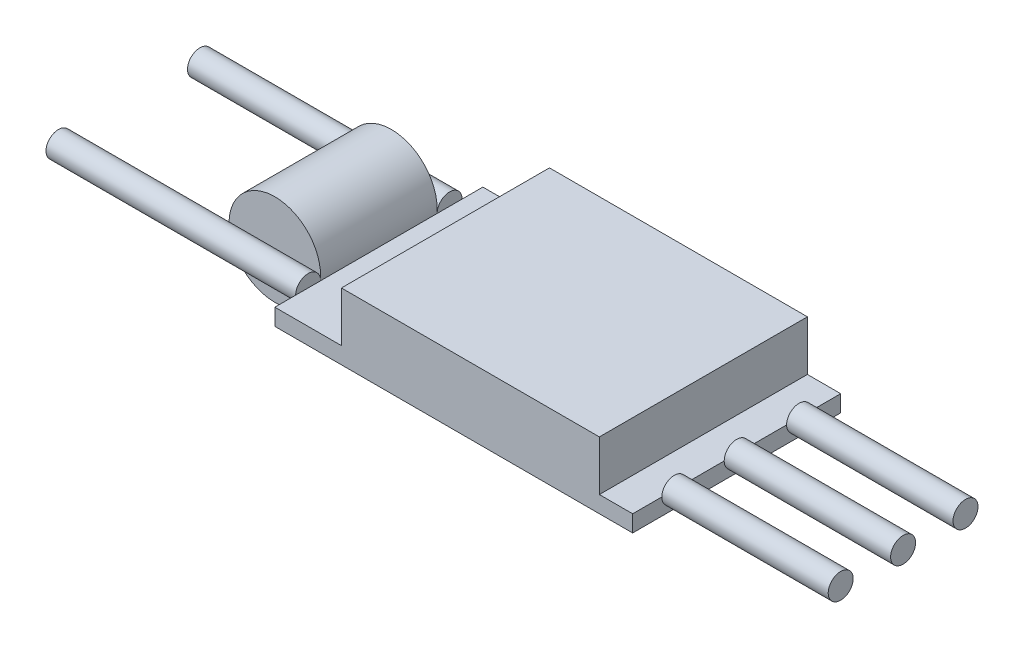
ISO-10303-21;
HEADER;
FILE_DESCRIPTION(('STEP AP214'),'2;1');
FILE_NAME('part.step','',(''),(''),'','','');
FILE_SCHEMA(('AUTOMOTIVE_DESIGN { 1 0 10303 214 1 1 1 1 }'));
ENDSEC;
DATA;
#1=APPLICATION_CONTEXT('core data for automotive mechanical design processes');
#2=APPLICATION_PROTOCOL_DEFINITION('international standard','automotive_design',2000,#1);
#3=PRODUCT_CONTEXT('',#1,'mechanical');
#4=PRODUCT('Part','Part','',(#3));
#5=PRODUCT_RELATED_PRODUCT_CATEGORY('part','',(#4));
#6=PRODUCT_DEFINITION_FORMATION('','',#4);
#7=PRODUCT_DEFINITION_CONTEXT('part definition',#1,'design');
#8=PRODUCT_DEFINITION('design','',#6,#7);
#9=PRODUCT_DEFINITION_SHAPE('','',#8);
#10=(LENGTH_UNIT() NAMED_UNIT(*) SI_UNIT(.MILLI.,.METRE.));
#11=(NAMED_UNIT(*) PLANE_ANGLE_UNIT() SI_UNIT($,.RADIAN.));
#12=(NAMED_UNIT(*) SI_UNIT($,.STERADIAN.) SOLID_ANGLE_UNIT());
#13=UNCERTAINTY_MEASURE_WITH_UNIT(LENGTH_MEASURE(1.E-05),#10,'distance_accuracy_value','');
#14=(GEOMETRIC_REPRESENTATION_CONTEXT(3) GLOBAL_UNCERTAINTY_ASSIGNED_CONTEXT((#13)) GLOBAL_UNIT_ASSIGNED_CONTEXT((#10,
#11,#12)) REPRESENTATION_CONTEXT('',''));
#15=CARTESIAN_POINT('',(0.,0.,0.));
#16=DIRECTION('',(0.,0.,1.));
#17=DIRECTION('',(1.,0.,0.));
#18=AXIS2_PLACEMENT_3D('',#15,#16,#17);
#19=CARTESIAN_POINT('',(-27.,2.5,7.));
#20=DIRECTION('',(0.,0.,-1.));
#21=DIRECTION('',(-1.,0.,0.));
#22=AXIS2_PLACEMENT_3D('',#19,#20,#21);
#23=CYLINDRICAL_SURFACE('',#22,5.5);
#24=CARTESIAN_POINT('',(-27.,2.5,7.));
#25=DIRECTION('',(0.,0.,1.));
#26=DIRECTION('',(1.,0.,0.));
#27=AXIS2_PLACEMENT_3D('',#24,#25,#26);
#28=CIRCLE('',#27,5.5);
#29=CARTESIAN_POINT('',(-21.5,2.5,7.));
#30=VERTEX_POINT('',#29);
#31=EDGE_CURVE('E11',#30,#30,#28,.T.);
#32=ORIENTED_EDGE('',*,*,#31,.F.);
#33=EDGE_LOOP('',(#32));
#34=FACE_BOUND('',#33,.T.);
#35=CARTESIAN_POINT('',(-27.,2.5,-7.));
#36=DIRECTION('',(0.,0.,1.));
#37=DIRECTION('',(1.,0.,0.));
#38=AXIS2_PLACEMENT_3D('',#35,#36,#37);
#39=CIRCLE('',#38,5.5);
#40=CARTESIAN_POINT('',(-21.5,2.5,-7.));
#41=VERTEX_POINT('',#40);
#42=EDGE_CURVE('E47',#41,#41,#39,.T.);
#43=ORIENTED_EDGE('',*,*,#42,.T.);
#44=EDGE_LOOP('',(#43));
#45=FACE_BOUND('',#44,.T.);
#46=ADVANCED_FACE('F44',(#34,#45),#23,.T.);
#47=CARTESIAN_POINT('',(-27.,2.5,7.));
#48=DIRECTION('',(0.,0.,1.));
#49=DIRECTION('',(1.,0.,0.));
#50=AXIS2_PLACEMENT_3D('',#47,#48,#49);
#51=PLANE('',#50);
#52=ORIENTED_EDGE('',*,*,#31,.T.);
#53=EDGE_LOOP('',(#52));
#54=FACE_BOUND('',#53,.T.);
#55=ADVANCED_FACE('F59',(#54),#51,.T.);
#56=CARTESIAN_POINT('',(-27.,2.5,-7.));
#57=DIRECTION('',(0.,0.,1.));
#58=DIRECTION('',(1.,0.,0.));
#59=AXIS2_PLACEMENT_3D('',#56,#57,#58);
#60=PLANE('',#59);
#61=ORIENTED_EDGE('',*,*,#42,.F.);
#62=EDGE_LOOP('',(#61));
#63=FACE_BOUND('',#62,.T.);
#64=ADVANCED_FACE('F57',(#63),#60,.F.);
#65=CLOSED_SHELL('',(#46,#55,#64));
#66=MANIFOLD_SOLID_BREP('B2',#65);
#67=CARTESIAN_POINT('',(21.5,2.,12.5));
#68=DIRECTION('',(-1.,0.,0.));
#69=DIRECTION('',(0.,0.,1.));
#70=AXIS2_PLACEMENT_3D('',#67,#68,#69);
#71=PLANE('',#70);
#72=CARTESIAN_POINT('',(21.5,2.,-7.5));
#73=DIRECTION('',(1.,0.,0.));
#74=DIRECTION('',(0.,0.,-1.));
#75=AXIS2_PLACEMENT_3D('',#72,#73,#74);
#76=CIRCLE('',#75,1.5);
#77=CARTESIAN_POINT('',(21.5,2.,-6.));
#78=VERTEX_POINT('',#77);
#79=CARTESIAN_POINT('',(21.5,2.,-9.00000000000001));
#80=VERTEX_POINT('',#79);
#81=EDGE_CURVE('E190',#78,#80,#76,.T.);
#82=ORIENTED_EDGE('',*,*,#81,.F.);
#83=DIRECTION('',(0.,0.,-1.));
#84=VECTOR('',#83,1.);
#85=CARTESIAN_POINT('',(21.5,2.,12.5));
#86=LINE('',#85,#84);
#87=CARTESIAN_POINT('',(21.5,2.,-1.5));
#88=VERTEX_POINT('',#87);
#89=EDGE_CURVE('E184',#88,#78,#86,.T.);
#90=ORIENTED_EDGE('',*,*,#89,.F.);
#91=CARTESIAN_POINT('',(21.5,2.,0.));
#92=DIRECTION('',(1.,0.,0.));
#93=DIRECTION('',(0.,0.,-1.));
#94=AXIS2_PLACEMENT_3D('',#91,#92,#93);
#95=CIRCLE('',#94,1.5);
#96=CARTESIAN_POINT('',(21.5,2.,1.5));
#97=VERTEX_POINT('',#96);
#98=EDGE_CURVE('E315',#97,#88,#95,.T.);
#99=ORIENTED_EDGE('',*,*,#98,.F.);
#100=CARTESIAN_POINT('',(21.5,2.,6.));
#101=VERTEX_POINT('',#100);
#102=EDGE_CURVE('E202',#101,#97,#86,.T.);
#103=ORIENTED_EDGE('',*,*,#102,.F.);
#104=CARTESIAN_POINT('',(21.5,2.,7.5));
#105=DIRECTION('',(1.,0.,0.));
#106=DIRECTION('',(0.,0.,-1.));
#107=AXIS2_PLACEMENT_3D('',#104,#105,#106);
#108=CIRCLE('',#107,1.5);
#109=CARTESIAN_POINT('',(21.5,2.,9.00000000000001));
#110=VERTEX_POINT('',#109);
#111=EDGE_CURVE('E42',#110,#101,#108,.T.);
#112=ORIENTED_EDGE('',*,*,#111,.F.);
#113=CARTESIAN_POINT('',(21.5,2.,12.5));
#114=VERTEX_POINT('',#113);
#115=EDGE_CURVE('E203',#114,#110,#86,.T.);
#116=ORIENTED_EDGE('',*,*,#115,.F.);
#117=DIRECTION('',(0.,-1.,0.));
#118=VECTOR('',#117,1.);
#119=CARTESIAN_POINT('',(21.5,2.,12.5));
#120=LINE('',#119,#118);
#121=CARTESIAN_POINT('',(21.5,0.,12.5));
#122=VERTEX_POINT('',#121);
#123=EDGE_CURVE('E230',#114,#122,#120,.T.);
#124=ORIENTED_EDGE('',*,*,#123,.T.);
#125=DIRECTION('',(0.,0.,-1.));
#126=VECTOR('',#125,1.);
#127=CARTESIAN_POINT('',(21.5,0.,12.5));
#128=LINE('',#127,#126);
#129=CARTESIAN_POINT('',(21.5,0.,-12.5));
#130=VERTEX_POINT('',#129);
#131=EDGE_CURVE('E241',#122,#130,#128,.T.);
#132=ORIENTED_EDGE('',*,*,#131,.T.);
#133=DIRECTION('',(0.,-1.,0.));
#134=VECTOR('',#133,1.);
#135=CARTESIAN_POINT('',(21.5,2.,-12.5));
#136=LINE('',#135,#134);
#137=CARTESIAN_POINT('',(21.5,2.,-12.5));
#138=VERTEX_POINT('',#137);
#139=EDGE_CURVE('E233',#138,#130,#136,.T.);
#140=ORIENTED_EDGE('',*,*,#139,.F.);
#141=EDGE_CURVE('E185',#80,#138,#86,.T.);
#142=ORIENTED_EDGE('',*,*,#141,.F.);
#143=EDGE_LOOP('',(#82,#90,#99,#103,#112,#116,#124,#132,#140,#142));
#144=FACE_BOUND('',#143,.T.);
#145=ADVANCED_FACE('F84',(#144),#71,.F.);
#146=CARTESIAN_POINT('',(-21.5,2.,12.5));
#147=DIRECTION('',(1.,0.,0.));
#148=DIRECTION('',(0.,0.,-1.));
#149=AXIS2_PLACEMENT_3D('',#146,#147,#148);
#150=PLANE('',#149);
#151=CARTESIAN_POINT('',(-21.5,2.,8.5));
#152=DIRECTION('',(-1.,0.,0.));
#153=DIRECTION('',(0.,0.,1.));
#154=AXIS2_PLACEMENT_3D('',#151,#152,#153);
#155=CIRCLE('',#154,1.5);
#156=CARTESIAN_POINT('',(-21.5,2.,7.));
#157=VERTEX_POINT('',#156);
#158=CARTESIAN_POINT('',(-21.5,2.,10.));
#159=VERTEX_POINT('',#158);
#160=EDGE_CURVE('E306',#157,#159,#155,.T.);
#161=ORIENTED_EDGE('',*,*,#160,.F.);
#162=DIRECTION('',(0.,0.,1.));
#163=VECTOR('',#162,1.);
#164=CARTESIAN_POINT('',(-21.5,2.,12.5));
#165=LINE('',#164,#163);
#166=CARTESIAN_POINT('',(-21.5,2.,-7.));
#167=VERTEX_POINT('',#166);
#168=EDGE_CURVE('E347',#167,#157,#165,.T.);
#169=ORIENTED_EDGE('',*,*,#168,.F.);
#170=CARTESIAN_POINT('',(-21.5,2.,-8.5));
#171=DIRECTION('',(-1.,0.,0.));
#172=DIRECTION('',(0.,0.,1.));
#173=AXIS2_PLACEMENT_3D('',#170,#171,#172);
#174=CIRCLE('',#173,1.5);
#175=CARTESIAN_POINT('',(-21.5,2.,-10.));
#176=VERTEX_POINT('',#175);
#177=EDGE_CURVE('E93',#176,#167,#174,.T.);
#178=ORIENTED_EDGE('',*,*,#177,.F.);
#179=CARTESIAN_POINT('',(-21.5,2.,-12.5));
#180=VERTEX_POINT('',#179);
#181=EDGE_CURVE('E225',#180,#176,#165,.T.);
#182=ORIENTED_EDGE('',*,*,#181,.F.);
#183=DIRECTION('',(0.,-1.,0.));
#184=VECTOR('',#183,1.);
#185=CARTESIAN_POINT('',(-21.5,2.,-12.5));
#186=LINE('',#185,#184);
#187=CARTESIAN_POINT('',(-21.5,0.,-12.5));
#188=VERTEX_POINT('',#187);
#189=EDGE_CURVE('E221',#180,#188,#186,.T.);
#190=ORIENTED_EDGE('',*,*,#189,.T.);
#191=DIRECTION('',(0.,0.,1.));
#192=VECTOR('',#191,1.);
#193=CARTESIAN_POINT('',(-21.5,0.,12.5));
#194=LINE('',#193,#192);
#195=CARTESIAN_POINT('',(-21.5,0.,12.5));
#196=VERTEX_POINT('',#195);
#197=EDGE_CURVE('E213',#188,#196,#194,.T.);
#198=ORIENTED_EDGE('',*,*,#197,.T.);
#199=DIRECTION('',(0.,-1.,0.));
#200=VECTOR('',#199,1.);
#201=CARTESIAN_POINT('',(-21.5,2.,12.5));
#202=LINE('',#201,#200);
#203=CARTESIAN_POINT('',(-21.5,2.,12.5));
#204=VERTEX_POINT('',#203);
#205=EDGE_CURVE('E227',#204,#196,#202,.T.);
#206=ORIENTED_EDGE('',*,*,#205,.F.);
#207=EDGE_CURVE('E240',#159,#204,#165,.T.);
#208=ORIENTED_EDGE('',*,*,#207,.F.);
#209=EDGE_LOOP('',(#161,#169,#178,#182,#190,#198,#206,#208));
#210=FACE_BOUND('',#209,.T.);
#211=ADVANCED_FACE('F86',(#210),#150,.F.);
#212=CARTESIAN_POINT('',(0.,2.,0.));
#213=DIRECTION('',(0.,1.,0.));
#214=DIRECTION('',(0.,0.,1.));
#215=AXIS2_PLACEMENT_3D('',#212,#213,#214);
#216=PLANE('',#215);
#217=DIRECTION('',(0.,0.,1.));
#218=VECTOR('',#217,1.);
#219=CARTESIAN_POINT('',(-13.5,2.,-12.5));
#220=LINE('',#219,#218);
#221=CARTESIAN_POINT('',(-13.5,2.,-12.5));
#222=VERTEX_POINT('',#221);
#223=CARTESIAN_POINT('',(-13.5,2.,12.5));
#224=VERTEX_POINT('',#223);
#225=EDGE_CURVE('E264',#222,#224,#220,.T.);
#226=ORIENTED_EDGE('',*,*,#225,.F.);
#227=DIRECTION('',(-1.,0.,0.));
#228=VECTOR('',#227,1.);
#229=CARTESIAN_POINT('',(21.5,2.,-12.5));
#230=LINE('',#229,#228);
#231=EDGE_CURVE('E207',#222,#180,#230,.T.);
#232=ORIENTED_EDGE('',*,*,#231,.T.);
#233=ORIENTED_EDGE('',*,*,#181,.T.);
#234=EDGE_CURVE('E346',#176,#167,#165,.T.);
#235=ORIENTED_EDGE('',*,*,#234,.T.);
#236=ORIENTED_EDGE('',*,*,#168,.T.);
#237=EDGE_CURVE('E348',#157,#159,#165,.T.);
#238=ORIENTED_EDGE('',*,*,#237,.T.);
#239=ORIENTED_EDGE('',*,*,#207,.T.);
#240=DIRECTION('',(1.,0.,0.));
#241=VECTOR('',#240,1.);
#242=CARTESIAN_POINT('',(21.5,2.,12.5));
#243=LINE('',#242,#241);
#244=EDGE_CURVE('E224',#204,#224,#243,.T.);
#245=ORIENTED_EDGE('',*,*,#244,.T.);
#246=EDGE_LOOP('',(#226,#232,#233,#235,#236,#238,#239,#245));
#247=FACE_BOUND('',#246,.T.);
#248=ADVANCED_FACE('F352',(#247),#216,.T.);
#249=CARTESIAN_POINT('',(21.5,2.,12.5));
#250=DIRECTION('',(0.,0.,-1.));
#251=DIRECTION('',(-1.,0.,0.));
#252=AXIS2_PLACEMENT_3D('',#249,#250,#251);
#253=PLANE('',#252);
#254=DIRECTION('',(1.,0.,0.));
#255=VECTOR('',#254,1.);
#256=CARTESIAN_POINT('',(21.5,0.,12.5));
#257=LINE('',#256,#255);
#258=EDGE_CURVE('E242',#196,#122,#257,.T.);
#259=ORIENTED_EDGE('',*,*,#258,.T.);
#260=ORIENTED_EDGE('',*,*,#123,.F.);
#261=CARTESIAN_POINT('',(17.5,2.,12.5));
#262=VERTEX_POINT('',#261);
#263=EDGE_CURVE('E222',#262,#114,#243,.T.);
#264=ORIENTED_EDGE('',*,*,#263,.F.);
#265=DIRECTION('',(0.,-1.,0.));
#266=VECTOR('',#265,1.);
#267=CARTESIAN_POINT('',(17.5,8.,12.5));
#268=LINE('',#267,#266);
#269=CARTESIAN_POINT('',(17.5,8.,12.5));
#270=VERTEX_POINT('',#269);
#271=EDGE_CURVE('E251',#270,#262,#268,.T.);
#272=ORIENTED_EDGE('',*,*,#271,.F.);
#273=DIRECTION('',(1.,0.,0.));
#274=VECTOR('',#273,1.);
#275=CARTESIAN_POINT('',(-13.5,8.,12.5));
#276=LINE('',#275,#274);
#277=CARTESIAN_POINT('',(-13.5,8.,12.5));
#278=VERTEX_POINT('',#277);
#279=EDGE_CURVE('E292',#278,#270,#276,.T.);
#280=ORIENTED_EDGE('',*,*,#279,.F.);
#281=DIRECTION('',(0.,-1.,0.));
#282=VECTOR('',#281,1.);
#283=CARTESIAN_POINT('',(-13.5,8.,12.5));
#284=LINE('',#283,#282);
#285=EDGE_CURVE('E246',#278,#224,#284,.T.);
#286=ORIENTED_EDGE('',*,*,#285,.T.);
#287=ORIENTED_EDGE('',*,*,#244,.F.);
#288=ORIENTED_EDGE('',*,*,#205,.T.);
#289=EDGE_LOOP('',(#259,#260,#264,#272,#280,#286,#287,#288));
#290=FACE_BOUND('',#289,.T.);
#291=ADVANCED_FACE('F380',(#290),#253,.F.);
#292=CARTESIAN_POINT('',(21.5,2.,-12.5));
#293=DIRECTION('',(0.,0.,1.));
#294=DIRECTION('',(1.,0.,0.));
#295=AXIS2_PLACEMENT_3D('',#292,#293,#294);
#296=PLANE('',#295);
#297=DIRECTION('',(-1.,0.,0.));
#298=VECTOR('',#297,1.);
#299=CARTESIAN_POINT('',(21.5,0.,-12.5));
#300=LINE('',#299,#298);
#301=EDGE_CURVE('E238',#130,#188,#300,.T.);
#302=ORIENTED_EDGE('',*,*,#301,.T.);
#303=ORIENTED_EDGE('',*,*,#189,.F.);
#304=ORIENTED_EDGE('',*,*,#231,.F.);
#305=DIRECTION('',(0.,-1.,0.));
#306=VECTOR('',#305,1.);
#307=CARTESIAN_POINT('',(-13.5,8.,-12.5));
#308=LINE('',#307,#306);
#309=CARTESIAN_POINT('',(-13.5,8.,-12.5));
#310=VERTEX_POINT('',#309);
#311=EDGE_CURVE('E268',#310,#222,#308,.T.);
#312=ORIENTED_EDGE('',*,*,#311,.F.);
#313=DIRECTION('',(-1.,0.,0.));
#314=VECTOR('',#313,1.);
#315=CARTESIAN_POINT('',(-13.5,8.,-12.5));
#316=LINE('',#315,#314);
#317=CARTESIAN_POINT('',(17.5,8.,-12.5));
#318=VERTEX_POINT('',#317);
#319=EDGE_CURVE('E272',#318,#310,#316,.T.);
#320=ORIENTED_EDGE('',*,*,#319,.F.);
#321=DIRECTION('',(0.,-1.,0.));
#322=VECTOR('',#321,1.);
#323=CARTESIAN_POINT('',(17.5,8.,-12.5));
#324=LINE('',#323,#322);
#325=CARTESIAN_POINT('',(17.5,2.,-12.5));
#326=VERTEX_POINT('',#325);
#327=EDGE_CURVE('E257',#318,#326,#324,.T.);
#328=ORIENTED_EDGE('',*,*,#327,.T.);
#329=EDGE_CURVE('E219',#138,#326,#230,.T.);
#330=ORIENTED_EDGE('',*,*,#329,.F.);
#331=ORIENTED_EDGE('',*,*,#139,.T.);
#332=EDGE_LOOP('',(#302,#303,#304,#312,#320,#328,#330,#331));
#333=FACE_BOUND('',#332,.T.);
#334=ADVANCED_FACE('F337',(#333),#296,.F.);
#335=DIRECTION('',(0.,0.,-1.));
#336=VECTOR('',#335,1.);
#337=CARTESIAN_POINT('',(17.5,2.,-12.5));
#338=LINE('',#337,#336);
#339=EDGE_CURVE('E266',#262,#326,#338,.T.);
#340=ORIENTED_EDGE('',*,*,#339,.F.);
#341=ORIENTED_EDGE('',*,*,#263,.T.);
#342=ORIENTED_EDGE('',*,*,#115,.T.);
#343=EDGE_CURVE('E208',#110,#101,#86,.T.);
#344=ORIENTED_EDGE('',*,*,#343,.T.);
#345=ORIENTED_EDGE('',*,*,#102,.T.);
#346=EDGE_CURVE('E201',#97,#88,#86,.T.);
#347=ORIENTED_EDGE('',*,*,#346,.T.);
#348=ORIENTED_EDGE('',*,*,#89,.T.);
#349=EDGE_CURVE('E180',#78,#80,#86,.T.);
#350=ORIENTED_EDGE('',*,*,#349,.T.);
#351=ORIENTED_EDGE('',*,*,#141,.T.);
#352=ORIENTED_EDGE('',*,*,#329,.T.);
#353=EDGE_LOOP('',(#340,#341,#342,#344,#345,#347,#348,#350,#351,#352));
#354=FACE_BOUND('',#353,.T.);
#355=ADVANCED_FACE('F199',(#354),#216,.T.);
#356=CARTESIAN_POINT('',(0.,0.,0.));
#357=DIRECTION('',(0.,1.,0.));
#358=DIRECTION('',(0.,0.,1.));
#359=AXIS2_PLACEMENT_3D('',#356,#357,#358);
#360=PLANE('',#359);
#361=ORIENTED_EDGE('',*,*,#197,.F.);
#362=ORIENTED_EDGE('',*,*,#301,.F.);
#363=ORIENTED_EDGE('',*,*,#131,.F.);
#364=ORIENTED_EDGE('',*,*,#258,.F.);
#365=EDGE_LOOP('',(#361,#362,#363,#364));
#366=FACE_BOUND('',#365,.T.);
#367=ADVANCED_FACE('F335',(#366),#360,.F.);
#368=CARTESIAN_POINT('',(-13.5,8.,-12.5));
#369=DIRECTION('',(1.,0.,0.));
#370=DIRECTION('',(0.,0.,-1.));
#371=AXIS2_PLACEMENT_3D('',#368,#369,#370);
#372=PLANE('',#371);
#373=ORIENTED_EDGE('',*,*,#225,.T.);
#374=ORIENTED_EDGE('',*,*,#285,.F.);
#375=DIRECTION('',(0.,0.,1.));
#376=VECTOR('',#375,1.);
#377=CARTESIAN_POINT('',(-13.5,8.,-12.5));
#378=LINE('',#377,#376);
#379=EDGE_CURVE('E277',#310,#278,#378,.T.);
#380=ORIENTED_EDGE('',*,*,#379,.F.);
#381=ORIENTED_EDGE('',*,*,#311,.T.);
#382=EDGE_LOOP('',(#373,#374,#380,#381));
#383=FACE_BOUND('',#382,.T.);
#384=ADVANCED_FACE('F394',(#383),#372,.F.);
#385=CARTESIAN_POINT('',(17.5,8.,-12.5));
#386=DIRECTION('',(-1.,0.,0.));
#387=DIRECTION('',(0.,0.,1.));
#388=AXIS2_PLACEMENT_3D('',#385,#386,#387);
#389=PLANE('',#388);
#390=ORIENTED_EDGE('',*,*,#339,.T.);
#391=ORIENTED_EDGE('',*,*,#327,.F.);
#392=DIRECTION('',(0.,0.,-1.));
#393=VECTOR('',#392,1.);
#394=CARTESIAN_POINT('',(17.5,8.,-12.5));
#395=LINE('',#394,#393);
#396=EDGE_CURVE('E289',#270,#318,#395,.T.);
#397=ORIENTED_EDGE('',*,*,#396,.F.);
#398=ORIENTED_EDGE('',*,*,#271,.T.);
#399=EDGE_LOOP('',(#390,#391,#397,#398));
#400=FACE_BOUND('',#399,.T.);
#401=ADVANCED_FACE('F398',(#400),#389,.F.);
#402=CARTESIAN_POINT('',(0.,8.,0.));
#403=DIRECTION('',(0.,1.,0.));
#404=DIRECTION('',(0.,0.,1.));
#405=AXIS2_PLACEMENT_3D('',#402,#403,#404);
#406=PLANE('',#405);
#407=ORIENTED_EDGE('',*,*,#379,.T.);
#408=ORIENTED_EDGE('',*,*,#279,.T.);
#409=ORIENTED_EDGE('',*,*,#396,.T.);
#410=ORIENTED_EDGE('',*,*,#319,.T.);
#411=EDGE_LOOP('',(#407,#408,#409,#410));
#412=FACE_BOUND('',#411,.T.);
#413=ADVANCED_FACE('F402',(#412),#406,.T.);
#414=CARTESIAN_POINT('',(-51.5,2.,-8.5));
#415=DIRECTION('',(1.,0.,0.));
#416=DIRECTION('',(0.,0.,-1.));
#417=AXIS2_PLACEMENT_3D('',#414,#415,#416);
#418=CYLINDRICAL_SURFACE('',#417,1.5);
#419=CARTESIAN_POINT('',(-51.5,2.,-8.5));
#420=DIRECTION('',(-1.,0.,0.));
#421=DIRECTION('',(0.,0.,1.));
#422=AXIS2_PLACEMENT_3D('',#419,#420,#421);
#423=CIRCLE('',#422,1.5);
#424=CARTESIAN_POINT('',(-51.5,2.,-7.));
#425=VERTEX_POINT('',#424);
#426=EDGE_CURVE('E267',#425,#425,#423,.T.);
#427=ORIENTED_EDGE('',*,*,#426,.F.);
#428=EDGE_LOOP('',(#427));
#429=FACE_BOUND('',#428,.T.);
#430=EDGE_CURVE('E297',#167,#176,#174,.T.);
#431=ORIENTED_EDGE('',*,*,#430,.T.);
#432=ORIENTED_EDGE('',*,*,#177,.T.);
#433=EDGE_LOOP('',(#431,#432));
#434=FACE_BOUND('',#433,.T.);
#435=ADVANCED_FACE('F356',(#429,#434),#418,.T.);
#436=CARTESIAN_POINT('',(-51.5,2.,-8.5));
#437=DIRECTION('',(-1.,0.,0.));
#438=DIRECTION('',(0.,0.,1.));
#439=AXIS2_PLACEMENT_3D('',#436,#437,#438);
#440=PLANE('',#439);
#441=ORIENTED_EDGE('',*,*,#426,.T.);
#442=EDGE_LOOP('',(#441));
#443=FACE_BOUND('',#442,.T.);
#444=ADVANCED_FACE('F361',(#443),#440,.T.);
#445=CARTESIAN_POINT('',(-21.5,2.,-8.5));
#446=DIRECTION('',(-1.,0.,0.));
#447=DIRECTION('',(0.,0.,1.));
#448=AXIS2_PLACEMENT_3D('',#445,#446,#447);
#449=PLANE('',#448);
#450=ORIENTED_EDGE('',*,*,#234,.F.);
#451=ORIENTED_EDGE('',*,*,#430,.F.);
#452=EDGE_LOOP('',(#450,#451));
#453=FACE_BOUND('',#452,.T.);
#454=ADVANCED_FACE('F358',(#453),#449,.F.);
#455=CARTESIAN_POINT('',(-51.5,2.,8.5));
#456=DIRECTION('',(1.,0.,0.));
#457=DIRECTION('',(0.,0.,-1.));
#458=AXIS2_PLACEMENT_3D('',#455,#456,#457);
#459=CYLINDRICAL_SURFACE('',#458,1.5);
#460=CARTESIAN_POINT('',(-51.5,2.,8.5));
#461=DIRECTION('',(-1.,0.,0.));
#462=DIRECTION('',(0.,0.,1.));
#463=AXIS2_PLACEMENT_3D('',#460,#461,#462);
#464=CIRCLE('',#463,1.5);
#465=CARTESIAN_POINT('',(-51.5,2.,10.));
#466=VERTEX_POINT('',#465);
#467=EDGE_CURVE('E300',#466,#466,#464,.T.);
#468=ORIENTED_EDGE('',*,*,#467,.F.);
#469=EDGE_LOOP('',(#468));
#470=FACE_BOUND('',#469,.T.);
#471=EDGE_CURVE('E303',#159,#157,#155,.T.);
#472=ORIENTED_EDGE('',*,*,#471,.T.);
#473=ORIENTED_EDGE('',*,*,#160,.T.);
#474=EDGE_LOOP('',(#472,#473));
#475=FACE_BOUND('',#474,.T.);
#476=ADVANCED_FACE('F360',(#470,#475),#459,.T.);
#477=CARTESIAN_POINT('',(-51.5,2.,8.5));
#478=DIRECTION('',(-1.,0.,0.));
#479=DIRECTION('',(0.,0.,1.));
#480=AXIS2_PLACEMENT_3D('',#477,#478,#479);
#481=PLANE('',#480);
#482=ORIENTED_EDGE('',*,*,#467,.T.);
#483=EDGE_LOOP('',(#482));
#484=FACE_BOUND('',#483,.T.);
#485=ADVANCED_FACE('F367',(#484),#481,.T.);
#486=CARTESIAN_POINT('',(-21.5,2.,8.5));
#487=DIRECTION('',(-1.,0.,0.));
#488=DIRECTION('',(0.,0.,1.));
#489=AXIS2_PLACEMENT_3D('',#486,#487,#488);
#490=PLANE('',#489);
#491=ORIENTED_EDGE('',*,*,#237,.F.);
#492=ORIENTED_EDGE('',*,*,#471,.F.);
#493=EDGE_LOOP('',(#491,#492));
#494=FACE_BOUND('',#493,.T.);
#495=ADVANCED_FACE('F427',(#494),#490,.F.);
#496=CARTESIAN_POINT('',(41.5,2.,7.5));
#497=DIRECTION('',(-1.,0.,0.));
#498=DIRECTION('',(0.,0.,1.));
#499=AXIS2_PLACEMENT_3D('',#496,#497,#498);
#500=CYLINDRICAL_SURFACE('',#499,1.5);
#501=CARTESIAN_POINT('',(41.5,2.,7.5));
#502=DIRECTION('',(1.,0.,0.));
#503=DIRECTION('',(0.,0.,-1.));
#504=AXIS2_PLACEMENT_3D('',#501,#502,#503);
#505=CIRCLE('',#504,1.5);
#506=CARTESIAN_POINT('',(41.5,2.,6.));
#507=VERTEX_POINT('',#506);
#508=EDGE_CURVE('E310',#507,#507,#505,.T.);
#509=ORIENTED_EDGE('',*,*,#508,.F.);
#510=EDGE_LOOP('',(#509));
#511=FACE_BOUND('',#510,.T.);
#512=EDGE_CURVE('E95',#101,#110,#108,.T.);
#513=ORIENTED_EDGE('',*,*,#512,.T.);
#514=ORIENTED_EDGE('',*,*,#111,.T.);
#515=EDGE_LOOP('',(#513,#514));
#516=FACE_BOUND('',#515,.T.);
#517=ADVANCED_FACE('F330',(#511,#516),#500,.T.);
#518=CARTESIAN_POINT('',(41.5,2.,7.5));
#519=DIRECTION('',(1.,0.,0.));
#520=DIRECTION('',(0.,0.,-1.));
#521=AXIS2_PLACEMENT_3D('',#518,#519,#520);
#522=PLANE('',#521);
#523=ORIENTED_EDGE('',*,*,#508,.T.);
#524=EDGE_LOOP('',(#523));
#525=FACE_BOUND('',#524,.T.);
#526=ADVANCED_FACE('F454',(#525),#522,.T.);
#527=CARTESIAN_POINT('',(21.5,2.,7.5));
#528=DIRECTION('',(1.,0.,0.));
#529=DIRECTION('',(0.,0.,-1.));
#530=AXIS2_PLACEMENT_3D('',#527,#528,#529);
#531=PLANE('',#530);
#532=ORIENTED_EDGE('',*,*,#343,.F.);
#533=ORIENTED_EDGE('',*,*,#512,.F.);
#534=EDGE_LOOP('',(#532,#533));
#535=FACE_BOUND('',#534,.T.);
#536=ADVANCED_FACE('F328',(#535),#531,.F.);
#537=CARTESIAN_POINT('',(41.5,2.,0.));
#538=DIRECTION('',(-1.,0.,0.));
#539=DIRECTION('',(0.,0.,1.));
#540=AXIS2_PLACEMENT_3D('',#537,#538,#539);
#541=CYLINDRICAL_SURFACE('',#540,1.5);
#542=CARTESIAN_POINT('',(41.5,2.,0.));
#543=DIRECTION('',(1.,0.,0.));
#544=DIRECTION('',(0.,0.,-1.));
#545=AXIS2_PLACEMENT_3D('',#542,#543,#544);
#546=CIRCLE('',#545,1.5);
#547=CARTESIAN_POINT('',(41.5,2.,-1.5));
#548=VERTEX_POINT('',#547);
#549=EDGE_CURVE('E311',#548,#548,#546,.T.);
#550=ORIENTED_EDGE('',*,*,#549,.F.);
#551=EDGE_LOOP('',(#550));
#552=FACE_BOUND('',#551,.T.);
#553=EDGE_CURVE('E108',#88,#97,#95,.T.);
#554=ORIENTED_EDGE('',*,*,#553,.T.);
#555=ORIENTED_EDGE('',*,*,#98,.T.);
#556=EDGE_LOOP('',(#554,#555));
#557=FACE_BOUND('',#556,.T.);
#558=ADVANCED_FACE('F322',(#552,#557),#541,.T.);
#559=CARTESIAN_POINT('',(41.5,2.,0.));
#560=DIRECTION('',(1.,0.,0.));
#561=DIRECTION('',(0.,0.,-1.));
#562=AXIS2_PLACEMENT_3D('',#559,#560,#561);
#563=PLANE('',#562);
#564=ORIENTED_EDGE('',*,*,#549,.T.);
#565=EDGE_LOOP('',(#564));
#566=FACE_BOUND('',#565,.T.);
#567=ADVANCED_FACE('F468',(#566),#563,.T.);
#568=CARTESIAN_POINT('',(21.5,2.,0.));
#569=DIRECTION('',(1.,0.,0.));
#570=DIRECTION('',(0.,0.,-1.));
#571=AXIS2_PLACEMENT_3D('',#568,#569,#570);
#572=PLANE('',#571);
#573=ORIENTED_EDGE('',*,*,#346,.F.);
#574=ORIENTED_EDGE('',*,*,#553,.F.);
#575=EDGE_LOOP('',(#573,#574));
#576=FACE_BOUND('',#575,.T.);
#577=ADVANCED_FACE('F473',(#576),#572,.F.);
#578=CARTESIAN_POINT('',(41.5,2.,-7.5));
#579=DIRECTION('',(-1.,0.,0.));
#580=DIRECTION('',(0.,0.,1.));
#581=AXIS2_PLACEMENT_3D('',#578,#579,#580);
#582=CYLINDRICAL_SURFACE('',#581,1.5);
#583=CARTESIAN_POINT('',(41.5,2.,-7.5));
#584=DIRECTION('',(1.,0.,0.));
#585=DIRECTION('',(0.,0.,-1.));
#586=AXIS2_PLACEMENT_3D('',#583,#584,#585);
#587=CIRCLE('',#586,1.5);
#588=CARTESIAN_POINT('',(41.5,2.,-9.00000000000001));
#589=VERTEX_POINT('',#588);
#590=EDGE_CURVE('E192',#589,#589,#587,.T.);
#591=ORIENTED_EDGE('',*,*,#590,.F.);
#592=EDGE_LOOP('',(#591));
#593=FACE_BOUND('',#592,.T.);
#594=EDGE_CURVE('E101',#80,#78,#76,.T.);
#595=ORIENTED_EDGE('',*,*,#594,.T.);
#596=ORIENTED_EDGE('',*,*,#81,.T.);
#597=EDGE_LOOP('',(#595,#596));
#598=FACE_BOUND('',#597,.T.);
#599=ADVANCED_FACE('F189',(#593,#598),#582,.T.);
#600=CARTESIAN_POINT('',(41.5,2.,-7.5));
#601=DIRECTION('',(1.,0.,0.));
#602=DIRECTION('',(0.,0.,-1.));
#603=AXIS2_PLACEMENT_3D('',#600,#601,#602);
#604=PLANE('',#603);
#605=ORIENTED_EDGE('',*,*,#590,.T.);
#606=EDGE_LOOP('',(#605));
#607=FACE_BOUND('',#606,.T.);
#608=ADVANCED_FACE('F441',(#607),#604,.T.);
#609=CARTESIAN_POINT('',(21.5,2.,-7.5));
#610=DIRECTION('',(1.,0.,0.));
#611=DIRECTION('',(0.,0.,-1.));
#612=AXIS2_PLACEMENT_3D('',#609,#610,#611);
#613=PLANE('',#612);
#614=ORIENTED_EDGE('',*,*,#349,.F.);
#615=ORIENTED_EDGE('',*,*,#594,.F.);
#616=EDGE_LOOP('',(#614,#615));
#617=FACE_BOUND('',#616,.T.);
#618=ADVANCED_FACE('F181',(#617),#613,.F.);
#619=CLOSED_SHELL('',(#145,#211,#248,#291,#334,#355,#367,#384,#401,#413,#435,#444,#454,#476,
#485,#495,#517,#526,#536,#558,#567,#577,#599,#608,#618));
#620=MANIFOLD_SOLID_BREP('B6',#619);
#621=ADVANCED_BREP_SHAPE_REPRESENTATION('',(#18,#66,#620),#14);
#622=SHAPE_DEFINITION_REPRESENTATION(#9,#621);
ENDSEC;
END-ISO-10303-21;
